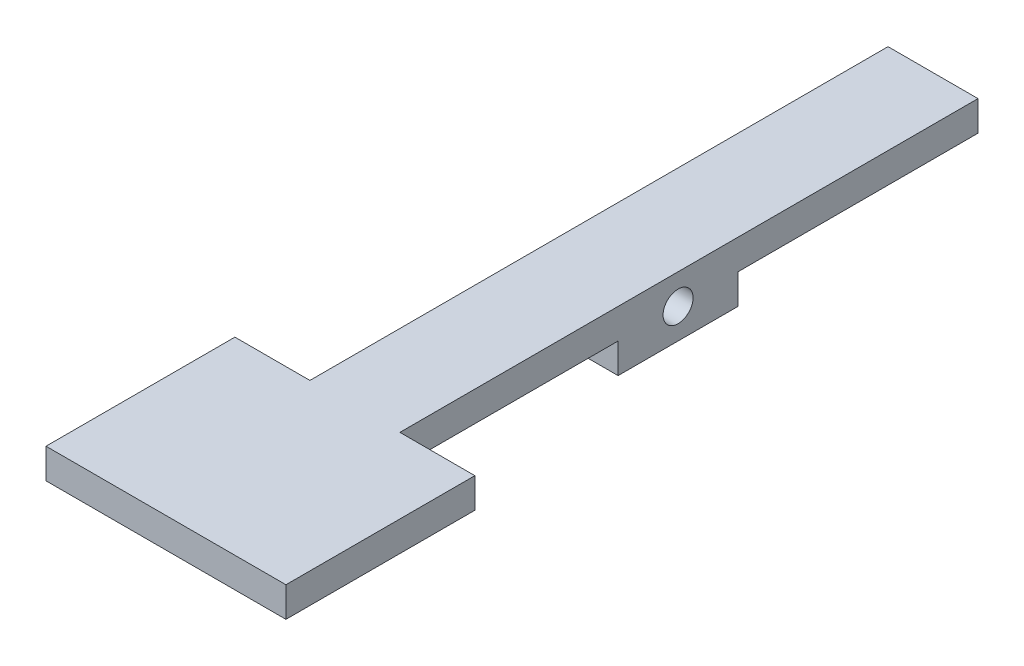
ISO-10303-21;
HEADER;
FILE_DESCRIPTION(('STEP AP214'),'2;1');
FILE_NAME('part.step','',(''),(''),'','','');
FILE_SCHEMA(('AUTOMOTIVE_DESIGN { 1 0 10303 214 1 1 1 1 }'));
ENDSEC;
DATA;
#1=APPLICATION_CONTEXT('core data for automotive mechanical design processes');
#2=APPLICATION_PROTOCOL_DEFINITION('international standard','automotive_design',2000,#1);
#3=PRODUCT_CONTEXT('',#1,'mechanical');
#4=PRODUCT('Part','Part','',(#3));
#5=PRODUCT_RELATED_PRODUCT_CATEGORY('part','',(#4));
#6=PRODUCT_DEFINITION_FORMATION('','',#4);
#7=PRODUCT_DEFINITION_CONTEXT('part definition',#1,'design');
#8=PRODUCT_DEFINITION('design','',#6,#7);
#9=PRODUCT_DEFINITION_SHAPE('','',#8);
#10=(LENGTH_UNIT() NAMED_UNIT(*) SI_UNIT(.MILLI.,.METRE.));
#11=(NAMED_UNIT(*) PLANE_ANGLE_UNIT() SI_UNIT($,.RADIAN.));
#12=(NAMED_UNIT(*) SI_UNIT($,.STERADIAN.) SOLID_ANGLE_UNIT());
#13=UNCERTAINTY_MEASURE_WITH_UNIT(LENGTH_MEASURE(1.E-05),#10,'distance_accuracy_value','');
#14=(GEOMETRIC_REPRESENTATION_CONTEXT(3) GLOBAL_UNCERTAINTY_ASSIGNED_CONTEXT((#13)) GLOBAL_UNIT_ASSIGNED_CONTEXT((#10,
#11,#12)) REPRESENTATION_CONTEXT('',''));
#15=CARTESIAN_POINT('',(0.,0.,0.));
#16=DIRECTION('',(0.,0.,1.));
#17=DIRECTION('',(1.,0.,0.));
#18=AXIS2_PLACEMENT_3D('',#15,#16,#17);
#19=CARTESIAN_POINT('',(9.525,0.,0.));
#20=DIRECTION('',(1.,0.,0.));
#21=DIRECTION('',(0.,0.,-1.));
#22=AXIS2_PLACEMENT_3D('',#19,#20,#21);
#23=PLANE('',#22);
#24=CARTESIAN_POINT('',(9.525,-1.5875,31.75));
#25=DIRECTION('',(1.,0.,0.));
#26=DIRECTION('',(0.,0.,-1.));
#27=AXIS2_PLACEMENT_3D('',#24,#25,#26);
#28=CIRCLE('',#27,1.5875);
#29=CARTESIAN_POINT('',(9.525,-1.5875,30.1625));
#30=VERTEX_POINT('',#29);
#31=EDGE_CURVE('E177',#30,#30,#28,.T.);
#32=ORIENTED_EDGE('',*,*,#31,.F.);
#33=EDGE_LOOP('',(#32));
#34=FACE_BOUND('',#33,.T.);
#35=DIRECTION('',(0.,0.,-1.));
#36=VECTOR('',#35,1.);
#37=CARTESIAN_POINT('',(9.525,1.5875,0.));
#38=LINE('',#37,#36);
#39=CARTESIAN_POINT('',(9.525,1.5875,61.2));
#40=VERTEX_POINT('',#39);
#41=CARTESIAN_POINT('',(9.525,1.5875,0.));
#42=VERTEX_POINT('',#41);
#43=EDGE_CURVE('E71',#40,#42,#38,.T.);
#44=ORIENTED_EDGE('',*,*,#43,.F.);
#45=DIRECTION('',(0.,-1.,0.));
#46=VECTOR('',#45,1.);
#47=CARTESIAN_POINT('',(9.525,0.,61.2));
#48=LINE('',#47,#46);
#49=CARTESIAN_POINT('',(9.525,-1.58750000000001,61.2));
#50=VERTEX_POINT('',#49);
#51=EDGE_CURVE('E66',#40,#50,#48,.T.);
#52=ORIENTED_EDGE('',*,*,#51,.T.);
#53=DIRECTION('',(0.,0.,1.));
#54=VECTOR('',#53,1.);
#55=CARTESIAN_POINT('',(9.525,-1.5875,0.));
#56=LINE('',#55,#54);
#57=CARTESIAN_POINT('',(9.525,-1.5875,38.1));
#58=VERTEX_POINT('',#57);
#59=EDGE_CURVE('E184',#58,#50,#56,.T.);
#60=ORIENTED_EDGE('',*,*,#59,.F.);
#61=DIRECTION('',(0.,-1.,0.));
#62=VECTOR('',#61,1.);
#63=CARTESIAN_POINT('',(9.525,0.,38.1));
#64=LINE('',#63,#62);
#65=CARTESIAN_POINT('',(9.525,-4.7625,38.1));
#66=VERTEX_POINT('',#65);
#67=EDGE_CURVE('E187',#58,#66,#64,.T.);
#68=ORIENTED_EDGE('',*,*,#67,.T.);
#69=DIRECTION('',(0.,0.,-1.));
#70=VECTOR('',#69,1.);
#71=CARTESIAN_POINT('',(9.525,-4.7625,0.));
#72=LINE('',#71,#70);
#73=CARTESIAN_POINT('',(9.525,-4.7625,25.4));
#74=VERTEX_POINT('',#73);
#75=EDGE_CURVE('E191',#66,#74,#72,.T.);
#76=ORIENTED_EDGE('',*,*,#75,.T.);
#77=DIRECTION('',(0.,-1.,0.));
#78=VECTOR('',#77,1.);
#79=CARTESIAN_POINT('',(9.525,0.,25.4));
#80=LINE('',#79,#78);
#81=CARTESIAN_POINT('',(9.525,-1.5875,25.4));
#82=VERTEX_POINT('',#81);
#83=EDGE_CURVE('E194',#82,#74,#80,.T.);
#84=ORIENTED_EDGE('',*,*,#83,.F.);
#85=DIRECTION('',(0.,0.,1.));
#86=VECTOR('',#85,1.);
#87=CARTESIAN_POINT('',(9.525,-1.5875,0.));
#88=LINE('',#87,#86);
#89=CARTESIAN_POINT('',(9.525,-1.5875,0.));
#90=VERTEX_POINT('',#89);
#91=EDGE_CURVE('E198',#90,#82,#88,.T.);
#92=ORIENTED_EDGE('',*,*,#91,.F.);
#93=DIRECTION('',(0.,-1.,0.));
#94=VECTOR('',#93,1.);
#95=CARTESIAN_POINT('',(9.525,0.,0.));
#96=LINE('',#95,#94);
#97=EDGE_CURVE('E202',#42,#90,#96,.T.);
#98=ORIENTED_EDGE('',*,*,#97,.F.);
#99=EDGE_LOOP('',(#44,#52,#60,#68,#76,#84,#92,#98));
#100=FACE_BOUND('',#99,.T.);
#101=ADVANCED_FACE('F50',(#34,#100),#23,.T.);
#102=CARTESIAN_POINT('',(0.,0.,0.));
#103=DIRECTION('',(1.,0.,0.));
#104=DIRECTION('',(0.,0.,-1.));
#105=AXIS2_PLACEMENT_3D('',#102,#103,#104);
#106=PLANE('',#105);
#107=CARTESIAN_POINT('',(0.,-1.5875,31.75));
#108=DIRECTION('',(1.,0.,0.));
#109=DIRECTION('',(0.,0.,-1.));
#110=AXIS2_PLACEMENT_3D('',#107,#108,#109);
#111=CIRCLE('',#110,1.5875);
#112=CARTESIAN_POINT('',(0.,-1.5875,30.1625));
#113=VERTEX_POINT('',#112);
#114=EDGE_CURVE('E171',#113,#113,#111,.T.);
#115=ORIENTED_EDGE('',*,*,#114,.T.);
#116=EDGE_LOOP('',(#115));
#117=FACE_BOUND('',#116,.T.);
#118=DIRECTION('',(0.,-1.,0.));
#119=VECTOR('',#118,1.);
#120=CARTESIAN_POINT('',(0.,0.,61.2));
#121=LINE('',#120,#119);
#122=CARTESIAN_POINT('',(0.,1.5875,61.2));
#123=VERTEX_POINT('',#122);
#124=CARTESIAN_POINT('',(0.,-1.5875,61.2));
#125=VERTEX_POINT('',#124);
#126=EDGE_CURVE('E11',#123,#125,#121,.T.);
#127=ORIENTED_EDGE('',*,*,#126,.F.);
#128=DIRECTION('',(0.,0.,-1.));
#129=VECTOR('',#128,1.);
#130=CARTESIAN_POINT('',(0.,1.5875,0.));
#131=LINE('',#130,#129);
#132=CARTESIAN_POINT('',(0.,1.5875,0.));
#133=VERTEX_POINT('',#132);
#134=EDGE_CURVE('E210',#123,#133,#131,.T.);
#135=ORIENTED_EDGE('',*,*,#134,.T.);
#136=DIRECTION('',(0.,-1.,0.));
#137=VECTOR('',#136,1.);
#138=CARTESIAN_POINT('',(0.,0.,0.));
#139=LINE('',#138,#137);
#140=CARTESIAN_POINT('',(0.,-1.5875,0.));
#141=VERTEX_POINT('',#140);
#142=EDGE_CURVE('E181',#133,#141,#139,.T.);
#143=ORIENTED_EDGE('',*,*,#142,.T.);
#144=DIRECTION('',(0.,0.,1.));
#145=VECTOR('',#144,1.);
#146=CARTESIAN_POINT('',(0.,-1.5875,0.));
#147=LINE('',#146,#145);
#148=CARTESIAN_POINT('',(0.,-1.5875,25.4));
#149=VERTEX_POINT('',#148);
#150=EDGE_CURVE('E228',#141,#149,#147,.T.);
#151=ORIENTED_EDGE('',*,*,#150,.T.);
#152=DIRECTION('',(0.,-1.,0.));
#153=VECTOR('',#152,1.);
#154=CARTESIAN_POINT('',(0.,0.,25.4));
#155=LINE('',#154,#153);
#156=CARTESIAN_POINT('',(0.,-4.7625,25.4));
#157=VERTEX_POINT('',#156);
#158=EDGE_CURVE('E224',#149,#157,#155,.T.);
#159=ORIENTED_EDGE('',*,*,#158,.T.);
#160=DIRECTION('',(0.,0.,-1.));
#161=VECTOR('',#160,1.);
#162=CARTESIAN_POINT('',(0.,-4.7625,0.));
#163=LINE('',#162,#161);
#164=CARTESIAN_POINT('',(0.,-4.7625,38.1));
#165=VERTEX_POINT('',#164);
#166=EDGE_CURVE('E220',#165,#157,#163,.T.);
#167=ORIENTED_EDGE('',*,*,#166,.F.);
#168=DIRECTION('',(0.,-1.,0.));
#169=VECTOR('',#168,1.);
#170=CARTESIAN_POINT('',(0.,0.,38.1));
#171=LINE('',#170,#169);
#172=CARTESIAN_POINT('',(0.,-1.5875,38.1));
#173=VERTEX_POINT('',#172);
#174=EDGE_CURVE('E216',#173,#165,#171,.T.);
#175=ORIENTED_EDGE('',*,*,#174,.F.);
#176=DIRECTION('',(0.,0.,1.));
#177=VECTOR('',#176,1.);
#178=CARTESIAN_POINT('',(0.,-1.5875,0.));
#179=LINE('',#178,#177);
#180=EDGE_CURVE('E213',#173,#125,#179,.T.);
#181=ORIENTED_EDGE('',*,*,#180,.T.);
#182=EDGE_LOOP('',(#127,#135,#143,#151,#159,#167,#175,#181));
#183=FACE_BOUND('',#182,.T.);
#184=ADVANCED_FACE('F260',(#117,#183),#106,.F.);
#185=CARTESIAN_POINT('',(9.525,1.5875,0.));
#186=DIRECTION('',(0.,1.,0.));
#187=DIRECTION('',(0.,0.,1.));
#188=AXIS2_PLACEMENT_3D('',#185,#186,#187);
#189=PLANE('',#188);
#190=DIRECTION('',(-1.,0.,0.));
#191=VECTOR('',#190,1.);
#192=CARTESIAN_POINT('',(17.4625,1.5875,61.2));
#193=LINE('',#192,#191);
#194=CARTESIAN_POINT('',(17.4625,1.5875,61.2));
#195=VERTEX_POINT('',#194);
#196=EDGE_CURVE('E271',#195,#40,#193,.T.);
#197=ORIENTED_EDGE('',*,*,#196,.T.);
#198=ORIENTED_EDGE('',*,*,#43,.T.);
#199=DIRECTION('',(-1.,0.,0.));
#200=VECTOR('',#199,1.);
#201=CARTESIAN_POINT('',(9.525,1.5875,0.));
#202=LINE('',#201,#200);
#203=EDGE_CURVE('E206',#42,#133,#202,.T.);
#204=ORIENTED_EDGE('',*,*,#203,.T.);
#205=ORIENTED_EDGE('',*,*,#134,.F.);
#206=CARTESIAN_POINT('',(-7.9375,1.5875,61.2));
#207=VERTEX_POINT('',#206);
#208=EDGE_CURVE('E276',#123,#207,#193,.T.);
#209=ORIENTED_EDGE('',*,*,#208,.T.);
#210=DIRECTION('',(0.,0.,1.));
#211=VECTOR('',#210,1.);
#212=CARTESIAN_POINT('',(-7.9375,1.58750000000001,0.));
#213=LINE('',#212,#211);
#214=CARTESIAN_POINT('',(-7.9375,1.5875,81.2));
#215=VERTEX_POINT('',#214);
#216=EDGE_CURVE('E165',#207,#215,#213,.T.);
#217=ORIENTED_EDGE('',*,*,#216,.T.);
#218=DIRECTION('',(-1.,0.,0.));
#219=VECTOR('',#218,1.);
#220=CARTESIAN_POINT('',(17.4625,1.5875,81.2));
#221=LINE('',#220,#219);
#222=CARTESIAN_POINT('',(17.4625,1.5875,81.2));
#223=VERTEX_POINT('',#222);
#224=EDGE_CURVE('E143',#223,#215,#221,.T.);
#225=ORIENTED_EDGE('',*,*,#224,.F.);
#226=DIRECTION('',(0.,0.,1.));
#227=VECTOR('',#226,1.);
#228=CARTESIAN_POINT('',(17.4625,1.58750000000001,0.));
#229=LINE('',#228,#227);
#230=EDGE_CURVE('E151',#195,#223,#229,.T.);
#231=ORIENTED_EDGE('',*,*,#230,.F.);
#232=EDGE_LOOP('',(#197,#198,#204,#205,#209,#217,#225,#231));
#233=FACE_BOUND('',#232,.T.);
#234=ADVANCED_FACE('F163',(#233),#189,.T.);
#235=CARTESIAN_POINT('',(9.525,-1.5875,0.));
#236=DIRECTION('',(0.,-1.,0.));
#237=DIRECTION('',(0.,0.,-1.));
#238=AXIS2_PLACEMENT_3D('',#235,#236,#237);
#239=PLANE('',#238);
#240=DIRECTION('',(-1.,0.,0.));
#241=VECTOR('',#240,1.);
#242=CARTESIAN_POINT('',(17.4625,-1.5875,61.2));
#243=LINE('',#242,#241);
#244=CARTESIAN_POINT('',(-7.9375,-1.5875,61.2));
#245=VERTEX_POINT('',#244);
#246=EDGE_CURVE('E264',#125,#245,#243,.T.);
#247=ORIENTED_EDGE('',*,*,#246,.F.);
#248=ORIENTED_EDGE('',*,*,#180,.F.);
#249=DIRECTION('',(-1.,0.,0.));
#250=VECTOR('',#249,1.);
#251=CARTESIAN_POINT('',(9.525,-1.5875,38.1));
#252=LINE('',#251,#250);
#253=EDGE_CURVE('E59',#58,#173,#252,.T.);
#254=ORIENTED_EDGE('',*,*,#253,.F.);
#255=ORIENTED_EDGE('',*,*,#59,.T.);
#256=CARTESIAN_POINT('',(17.4625,-1.5875,61.2));
#257=VERTEX_POINT('',#256);
#258=EDGE_CURVE('E173',#257,#50,#243,.T.);
#259=ORIENTED_EDGE('',*,*,#258,.F.);
#260=DIRECTION('',(0.,0.,-1.));
#261=VECTOR('',#260,1.);
#262=CARTESIAN_POINT('',(17.4625,-1.5875,0.));
#263=LINE('',#262,#261);
#264=CARTESIAN_POINT('',(17.4625,-1.58750000000001,81.2));
#265=VERTEX_POINT('',#264);
#266=EDGE_CURVE('E150',#265,#257,#263,.T.);
#267=ORIENTED_EDGE('',*,*,#266,.F.);
#268=DIRECTION('',(-1.,0.,0.));
#269=VECTOR('',#268,1.);
#270=CARTESIAN_POINT('',(17.4625,-1.58750000000001,81.2));
#271=LINE('',#270,#269);
#272=CARTESIAN_POINT('',(-7.9375,-1.58750000000001,81.2));
#273=VERTEX_POINT('',#272);
#274=EDGE_CURVE('E146',#265,#273,#271,.T.);
#275=ORIENTED_EDGE('',*,*,#274,.T.);
#276=DIRECTION('',(0.,0.,-1.));
#277=VECTOR('',#276,1.);
#278=CARTESIAN_POINT('',(-7.9375,-1.5875,0.));
#279=LINE('',#278,#277);
#280=EDGE_CURVE('E266',#273,#245,#279,.T.);
#281=ORIENTED_EDGE('',*,*,#280,.T.);
#282=EDGE_LOOP('',(#247,#248,#254,#255,#259,#267,#275,#281));
#283=FACE_BOUND('',#282,.T.);
#284=ADVANCED_FACE('F262',(#283),#239,.T.);
#285=CARTESIAN_POINT('',(9.525,0.,38.1));
#286=DIRECTION('',(0.,0.,-1.));
#287=DIRECTION('',(-1.,0.,0.));
#288=AXIS2_PLACEMENT_3D('',#285,#286,#287);
#289=PLANE('',#288);
#290=ORIENTED_EDGE('',*,*,#174,.T.);
#291=DIRECTION('',(-1.,0.,0.));
#292=VECTOR('',#291,1.);
#293=CARTESIAN_POINT('',(9.525,-4.7625,38.1));
#294=LINE('',#293,#292);
#295=EDGE_CURVE('E247',#66,#165,#294,.T.);
#296=ORIENTED_EDGE('',*,*,#295,.F.);
#297=ORIENTED_EDGE('',*,*,#67,.F.);
#298=ORIENTED_EDGE('',*,*,#253,.T.);
#299=EDGE_LOOP('',(#290,#296,#297,#298));
#300=FACE_BOUND('',#299,.T.);
#301=ADVANCED_FACE('F255',(#300),#289,.F.);
#302=CARTESIAN_POINT('',(9.525,-4.7625,0.));
#303=DIRECTION('',(0.,1.,0.));
#304=DIRECTION('',(0.,0.,1.));
#305=AXIS2_PLACEMENT_3D('',#302,#303,#304);
#306=PLANE('',#305);
#307=ORIENTED_EDGE('',*,*,#166,.T.);
#308=DIRECTION('',(-1.,0.,0.));
#309=VECTOR('',#308,1.);
#310=CARTESIAN_POINT('',(9.525,-4.7625,25.4));
#311=LINE('',#310,#309);
#312=EDGE_CURVE('E244',#74,#157,#311,.T.);
#313=ORIENTED_EDGE('',*,*,#312,.F.);
#314=ORIENTED_EDGE('',*,*,#75,.F.);
#315=ORIENTED_EDGE('',*,*,#295,.T.);
#316=EDGE_LOOP('',(#307,#313,#314,#315));
#317=FACE_BOUND('',#316,.T.);
#318=ADVANCED_FACE('F339',(#317),#306,.F.);
#319=CARTESIAN_POINT('',(9.525,0.,25.4));
#320=DIRECTION('',(0.,0.,-1.));
#321=DIRECTION('',(-1.,0.,0.));
#322=AXIS2_PLACEMENT_3D('',#319,#320,#321);
#323=PLANE('',#322);
#324=ORIENTED_EDGE('',*,*,#158,.F.);
#325=DIRECTION('',(-1.,0.,0.));
#326=VECTOR('',#325,1.);
#327=CARTESIAN_POINT('',(9.525,-1.5875,25.4));
#328=LINE('',#327,#326);
#329=EDGE_CURVE('E241',#82,#149,#328,.T.);
#330=ORIENTED_EDGE('',*,*,#329,.F.);
#331=ORIENTED_EDGE('',*,*,#83,.T.);
#332=ORIENTED_EDGE('',*,*,#312,.T.);
#333=EDGE_LOOP('',(#324,#330,#331,#332));
#334=FACE_BOUND('',#333,.T.);
#335=ADVANCED_FACE('F336',(#334),#323,.T.);
#336=CARTESIAN_POINT('',(9.525,-1.5875,0.));
#337=DIRECTION('',(0.,-1.,0.));
#338=DIRECTION('',(0.,0.,-1.));
#339=AXIS2_PLACEMENT_3D('',#336,#337,#338);
#340=PLANE('',#339);
#341=ORIENTED_EDGE('',*,*,#150,.F.);
#342=DIRECTION('',(-1.,0.,0.));
#343=VECTOR('',#342,1.);
#344=CARTESIAN_POINT('',(9.525,-1.5875,0.));
#345=LINE('',#344,#343);
#346=EDGE_CURVE('E238',#90,#141,#345,.T.);
#347=ORIENTED_EDGE('',*,*,#346,.F.);
#348=ORIENTED_EDGE('',*,*,#91,.T.);
#349=ORIENTED_EDGE('',*,*,#329,.T.);
#350=EDGE_LOOP('',(#341,#347,#348,#349));
#351=FACE_BOUND('',#350,.T.);
#352=ADVANCED_FACE('F304',(#351),#340,.T.);
#353=CARTESIAN_POINT('',(9.525,-1.5875,31.75));
#354=DIRECTION('',(-1.,0.,0.));
#355=DIRECTION('',(0.,0.,1.));
#356=AXIS2_PLACEMENT_3D('',#353,#354,#355);
#357=CYLINDRICAL_SURFACE('',#356,1.5875);
#358=ORIENTED_EDGE('',*,*,#31,.T.);
#359=EDGE_LOOP('',(#358));
#360=FACE_BOUND('',#359,.T.);
#361=ORIENTED_EDGE('',*,*,#114,.F.);
#362=EDGE_LOOP('',(#361));
#363=FACE_BOUND('',#362,.T.);
#364=ADVANCED_FACE('F52',(#360,#363),#357,.F.);
#365=CARTESIAN_POINT('',(9.525,0.,0.));
#366=DIRECTION('',(0.,0.,-1.));
#367=DIRECTION('',(0.,1.,0.));
#368=AXIS2_PLACEMENT_3D('',#365,#366,#367);
#369=PLANE('',#368);
#370=ORIENTED_EDGE('',*,*,#142,.F.);
#371=ORIENTED_EDGE('',*,*,#203,.F.);
#372=ORIENTED_EDGE('',*,*,#97,.T.);
#373=ORIENTED_EDGE('',*,*,#346,.T.);
#374=EDGE_LOOP('',(#370,#371,#372,#373));
#375=FACE_BOUND('',#374,.T.);
#376=ADVANCED_FACE('F299',(#375),#369,.T.);
#377=CARTESIAN_POINT('',(17.4625,0.,61.2));
#378=DIRECTION('',(0.,0.,1.));
#379=DIRECTION('',(1.,0.,0.));
#380=AXIS2_PLACEMENT_3D('',#377,#378,#379);
#381=PLANE('',#380);
#382=ORIENTED_EDGE('',*,*,#208,.F.);
#383=ORIENTED_EDGE('',*,*,#126,.T.);
#384=ORIENTED_EDGE('',*,*,#246,.T.);
#385=DIRECTION('',(0.,1.,0.));
#386=VECTOR('',#385,1.);
#387=CARTESIAN_POINT('',(-7.9375,0.,61.2));
#388=LINE('',#387,#386);
#389=EDGE_CURVE('E161',#245,#207,#388,.T.);
#390=ORIENTED_EDGE('',*,*,#389,.T.);
#391=EDGE_LOOP('',(#382,#383,#384,#390));
#392=FACE_BOUND('',#391,.T.);
#393=ADVANCED_FACE('F307',(#392),#381,.F.);
#394=CARTESIAN_POINT('',(17.4625,0.,81.2));
#395=DIRECTION('',(0.,0.,-1.));
#396=DIRECTION('',(-1.,0.,0.));
#397=AXIS2_PLACEMENT_3D('',#394,#395,#396);
#398=PLANE('',#397);
#399=DIRECTION('',(0.,-1.,0.));
#400=VECTOR('',#399,1.);
#401=CARTESIAN_POINT('',(-7.9375,0.,81.2));
#402=LINE('',#401,#400);
#403=EDGE_CURVE('E283',#215,#273,#402,.T.);
#404=ORIENTED_EDGE('',*,*,#403,.T.);
#405=ORIENTED_EDGE('',*,*,#274,.F.);
#406=DIRECTION('',(0.,-1.,0.));
#407=VECTOR('',#406,1.);
#408=CARTESIAN_POINT('',(17.4625,0.,81.2));
#409=LINE('',#408,#407);
#410=EDGE_CURVE('E139',#223,#265,#409,.T.);
#411=ORIENTED_EDGE('',*,*,#410,.F.);
#412=ORIENTED_EDGE('',*,*,#224,.T.);
#413=EDGE_LOOP('',(#404,#405,#411,#412));
#414=FACE_BOUND('',#413,.T.);
#415=ADVANCED_FACE('F141',(#414),#398,.F.);
#416=ORIENTED_EDGE('',*,*,#51,.F.);
#417=ORIENTED_EDGE('',*,*,#196,.F.);
#418=DIRECTION('',(0.,1.,0.));
#419=VECTOR('',#418,1.);
#420=CARTESIAN_POINT('',(17.4625,0.,61.2));
#421=LINE('',#420,#419);
#422=EDGE_CURVE('E156',#257,#195,#421,.T.);
#423=ORIENTED_EDGE('',*,*,#422,.F.);
#424=ORIENTED_EDGE('',*,*,#258,.T.);
#425=EDGE_LOOP('',(#416,#417,#423,#424));
#426=FACE_BOUND('',#425,.T.);
#427=ADVANCED_FACE('F294',(#426),#381,.F.);
#428=CARTESIAN_POINT('',(17.4625,0.,0.));
#429=DIRECTION('',(1.,0.,0.));
#430=DIRECTION('',(0.,0.,-1.));
#431=AXIS2_PLACEMENT_3D('',#428,#429,#430);
#432=PLANE('',#431);
#433=ORIENTED_EDGE('',*,*,#230,.T.);
#434=ORIENTED_EDGE('',*,*,#410,.T.);
#435=ORIENTED_EDGE('',*,*,#266,.T.);
#436=ORIENTED_EDGE('',*,*,#422,.T.);
#437=EDGE_LOOP('',(#433,#434,#435,#436));
#438=FACE_BOUND('',#437,.T.);
#439=ADVANCED_FACE('F154',(#438),#432,.T.);
#440=CARTESIAN_POINT('',(-7.9375,0.,0.));
#441=DIRECTION('',(1.,0.,0.));
#442=DIRECTION('',(0.,0.,-1.));
#443=AXIS2_PLACEMENT_3D('',#440,#441,#442);
#444=PLANE('',#443);
#445=ORIENTED_EDGE('',*,*,#216,.F.);
#446=ORIENTED_EDGE('',*,*,#389,.F.);
#447=ORIENTED_EDGE('',*,*,#280,.F.);
#448=ORIENTED_EDGE('',*,*,#403,.F.);
#449=EDGE_LOOP('',(#445,#446,#447,#448));
#450=FACE_BOUND('',#449,.T.);
#451=ADVANCED_FACE('F313',(#450),#444,.F.);
#452=CLOSED_SHELL('',(#101,#184,#234,#284,#301,#318,#335,#352,#364,#376,#393,#415,#427,#439,#451));
#453=MANIFOLD_SOLID_BREP('B2',#452);
#454=ADVANCED_BREP_SHAPE_REPRESENTATION('',(#18,#453),#14);
#455=SHAPE_DEFINITION_REPRESENTATION(#9,#454);
ENDSEC;
END-ISO-10303-21;
